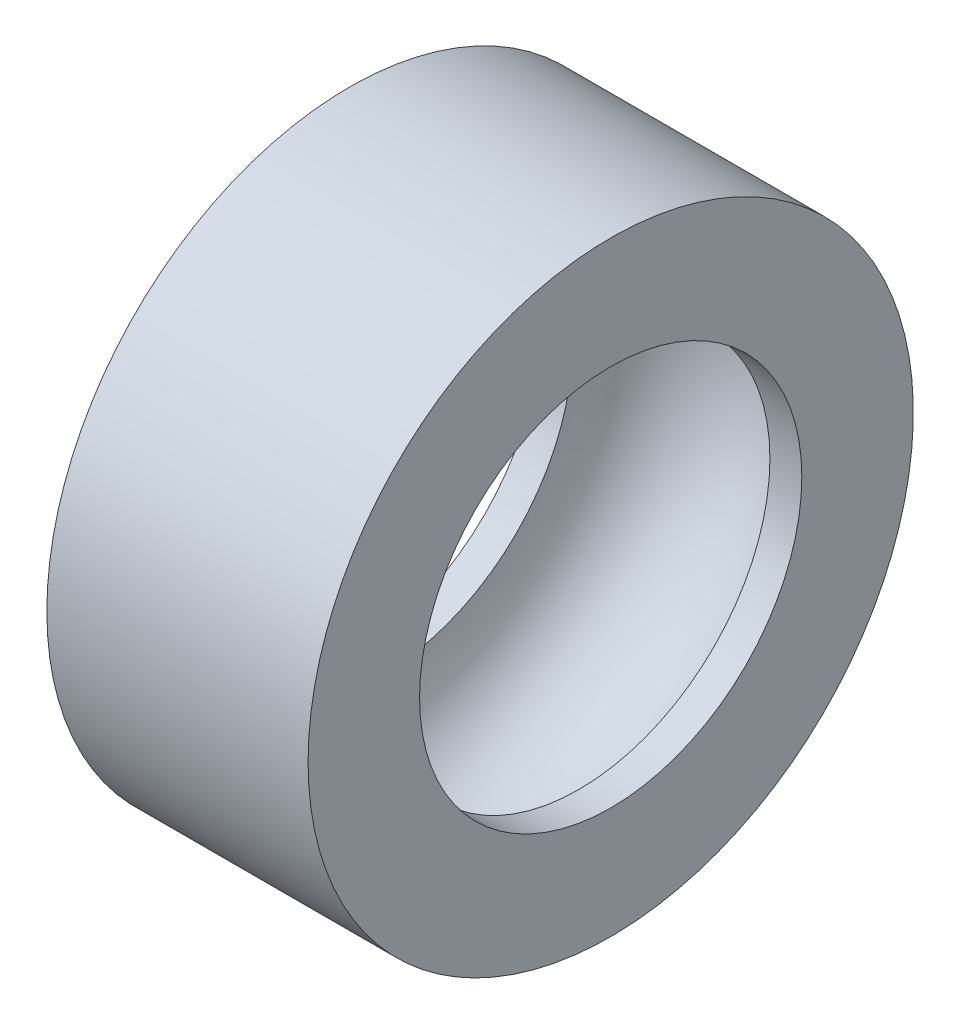
ISO-10303-21;
HEADER;
FILE_DESCRIPTION(('STEP AP214'),'2;1');
FILE_NAME('part.step','',(''),(''),'','','');
FILE_SCHEMA(('AUTOMOTIVE_DESIGN { 1 0 10303 214 1 1 1 1 }'));
ENDSEC;
DATA;
#1=APPLICATION_CONTEXT('core data for automotive mechanical design processes');
#2=APPLICATION_PROTOCOL_DEFINITION('international standard','automotive_design',2000,#1);
#3=PRODUCT_CONTEXT('',#1,'mechanical');
#4=PRODUCT('Part','Part','',(#3));
#5=PRODUCT_RELATED_PRODUCT_CATEGORY('part','',(#4));
#6=PRODUCT_DEFINITION_FORMATION('','',#4);
#7=PRODUCT_DEFINITION_CONTEXT('part definition',#1,'design');
#8=PRODUCT_DEFINITION('design','',#6,#7);
#9=PRODUCT_DEFINITION_SHAPE('','',#8);
#10=(LENGTH_UNIT() NAMED_UNIT(*) SI_UNIT(.MILLI.,.METRE.));
#11=(NAMED_UNIT(*) PLANE_ANGLE_UNIT() SI_UNIT($,.RADIAN.));
#12=(NAMED_UNIT(*) SI_UNIT($,.STERADIAN.) SOLID_ANGLE_UNIT());
#13=UNCERTAINTY_MEASURE_WITH_UNIT(LENGTH_MEASURE(1.E-05),#10,'distance_accuracy_value','');
#14=(GEOMETRIC_REPRESENTATION_CONTEXT(3) GLOBAL_UNCERTAINTY_ASSIGNED_CONTEXT((#13)) GLOBAL_UNIT_ASSIGNED_CONTEXT((#10,
#11,#12)) REPRESENTATION_CONTEXT('',''));
#15=CARTESIAN_POINT('',(0.,0.,0.));
#16=DIRECTION('',(0.,0.,1.));
#17=DIRECTION('',(1.,0.,0.));
#18=AXIS2_PLACEMENT_3D('',#15,#16,#17);
#19=CARTESIAN_POINT('',(-4.1,6.,0.));
#20=DIRECTION('',(1.,0.,0.));
#21=DIRECTION('',(0.,0.,-1.));
#22=AXIS2_PLACEMENT_3D('',#19,#20,#21);
#23=PLANE('',#22);
#24=CARTESIAN_POINT('',(-4.1,0.,0.));
#25=DIRECTION('',(-1.,0.,0.));
#26=DIRECTION('',(0.,0.,1.));
#27=AXIS2_PLACEMENT_3D('',#24,#25,#26);
#28=CIRCLE('',#27,6.);
#29=CARTESIAN_POINT('',(-4.1,0.,6.));
#30=VERTEX_POINT('',#29);
#31=EDGE_CURVE('E10',#30,#30,#28,.T.);
#32=ORIENTED_EDGE('',*,*,#31,.F.);
#33=EDGE_LOOP('',(#32));
#34=FACE_BOUND('',#33,.T.);
#35=CARTESIAN_POINT('',(-4.1,0.,0.));
#36=DIRECTION('',(-1.,0.,0.));
#37=DIRECTION('',(0.,0.,1.));
#38=AXIS2_PLACEMENT_3D('',#35,#36,#37);
#39=CIRCLE('',#38,9.5);
#40=CARTESIAN_POINT('',(-4.1,0.,9.5));
#41=VERTEX_POINT('',#40);
#42=EDGE_CURVE('E54',#41,#41,#39,.T.);
#43=ORIENTED_EDGE('',*,*,#42,.T.);
#44=EDGE_LOOP('',(#43));
#45=FACE_BOUND('',#44,.T.);
#46=ADVANCED_FACE('F32',(#34,#45),#23,.F.);
#47=CARTESIAN_POINT('',(-10.9005441856712,0.,0.));
#48=DIRECTION('',(-1.,0.,0.));
#49=DIRECTION('',(0.,0.,1.));
#50=AXIS2_PLACEMENT_3D('',#47,#48,#49);
#51=CYLINDRICAL_SURFACE('',#50,6.);
#52=CARTESIAN_POINT('',(-3.09838667696593,0.,0.));
#53=DIRECTION('',(-1.,0.,0.));
#54=DIRECTION('',(0.,0.,1.));
#55=AXIS2_PLACEMENT_3D('',#52,#53,#54);
#56=CIRCLE('',#55,6.);
#57=CARTESIAN_POINT('',(-3.09838667696593,0.,6.));
#58=VERTEX_POINT('',#57);
#59=EDGE_CURVE('E38',#58,#58,#56,.T.);
#60=ORIENTED_EDGE('',*,*,#59,.F.);
#61=EDGE_LOOP('',(#60));
#62=FACE_BOUND('',#61,.T.);
#63=ORIENTED_EDGE('',*,*,#31,.T.);
#64=EDGE_LOOP('',(#63));
#65=FACE_BOUND('',#64,.T.);
#66=ADVANCED_FACE('F79',(#62,#65),#51,.F.);
#67=CARTESIAN_POINT('',(0.,0.,0.));
#68=DIRECTION('',(-1.,0.,0.));
#69=DIRECTION('',(0.,0.,1.));
#70=AXIS2_PLACEMENT_3D('',#67,#68,#69);
#71=TOROIDAL_SURFACE('',#70,5.9,3.1);
#72=CARTESIAN_POINT('',(3.09838667696593,0.,0.));
#73=DIRECTION('',(-1.,0.,0.));
#74=DIRECTION('',(0.,0.,1.));
#75=AXIS2_PLACEMENT_3D('',#72,#73,#74);
#76=CIRCLE('',#75,6.);
#77=CARTESIAN_POINT('',(3.09838667696593,0.,6.));
#78=VERTEX_POINT('',#77);
#79=EDGE_CURVE('E42',#78,#78,#76,.T.);
#80=ORIENTED_EDGE('',*,*,#79,.F.);
#81=EDGE_LOOP('',(#80));
#82=FACE_BOUND('',#81,.T.);
#83=ORIENTED_EDGE('',*,*,#59,.T.);
#84=EDGE_LOOP('',(#83));
#85=FACE_BOUND('',#84,.T.);
#86=ADVANCED_FACE('F74',(#82,#85),#71,.F.);
#87=CARTESIAN_POINT('',(-10.9005441856712,0.,0.));
#88=DIRECTION('',(-1.,0.,0.));
#89=DIRECTION('',(0.,0.,1.));
#90=AXIS2_PLACEMENT_3D('',#87,#88,#89);
#91=CYLINDRICAL_SURFACE('',#90,6.);
#92=CARTESIAN_POINT('',(4.1,0.,0.));
#93=DIRECTION('',(-1.,0.,0.));
#94=DIRECTION('',(0.,0.,1.));
#95=AXIS2_PLACEMENT_3D('',#92,#93,#94);
#96=CIRCLE('',#95,6.);
#97=CARTESIAN_POINT('',(4.1,0.,6.));
#98=VERTEX_POINT('',#97);
#99=EDGE_CURVE('E46',#98,#98,#96,.T.);
#100=ORIENTED_EDGE('',*,*,#99,.F.);
#101=EDGE_LOOP('',(#100));
#102=FACE_BOUND('',#101,.T.);
#103=ORIENTED_EDGE('',*,*,#79,.T.);
#104=EDGE_LOOP('',(#103));
#105=FACE_BOUND('',#104,.T.);
#106=ADVANCED_FACE('F68',(#102,#105),#91,.F.);
#107=CARTESIAN_POINT('',(4.1,6.,0.));
#108=DIRECTION('',(-1.,0.,0.));
#109=DIRECTION('',(0.,0.,1.));
#110=AXIS2_PLACEMENT_3D('',#107,#108,#109);
#111=PLANE('',#110);
#112=CARTESIAN_POINT('',(4.1,0.,0.));
#113=DIRECTION('',(-1.,0.,0.));
#114=DIRECTION('',(0.,0.,1.));
#115=AXIS2_PLACEMENT_3D('',#112,#113,#114);
#116=CIRCLE('',#115,9.5);
#117=CARTESIAN_POINT('',(4.1,0.,9.5));
#118=VERTEX_POINT('',#117);
#119=EDGE_CURVE('E51',#118,#118,#116,.T.);
#120=ORIENTED_EDGE('',*,*,#119,.F.);
#121=EDGE_LOOP('',(#120));
#122=FACE_BOUND('',#121,.T.);
#123=ORIENTED_EDGE('',*,*,#99,.T.);
#124=EDGE_LOOP('',(#123));
#125=FACE_BOUND('',#124,.T.);
#126=ADVANCED_FACE('F62',(#122,#125),#111,.F.);
#127=CARTESIAN_POINT('',(-10.9005441856712,0.,0.));
#128=DIRECTION('',(-1.,0.,0.));
#129=DIRECTION('',(0.,0.,1.));
#130=AXIS2_PLACEMENT_3D('',#127,#128,#129);
#131=CYLINDRICAL_SURFACE('',#130,9.5);
#132=ORIENTED_EDGE('',*,*,#42,.F.);
#133=EDGE_LOOP('',(#132));
#134=FACE_BOUND('',#133,.T.);
#135=ORIENTED_EDGE('',*,*,#119,.T.);
#136=EDGE_LOOP('',(#135));
#137=FACE_BOUND('',#136,.T.);
#138=ADVANCED_FACE('F59',(#134,#137),#131,.T.);
#139=CLOSED_SHELL('',(#46,#66,#86,#106,#126,#138));
#140=MANIFOLD_SOLID_BREP('B2',#139);
#141=ADVANCED_BREP_SHAPE_REPRESENTATION('',(#18,#140),#14);
#142=SHAPE_DEFINITION_REPRESENTATION(#9,#141);
ENDSEC;
END-ISO-10303-21;
